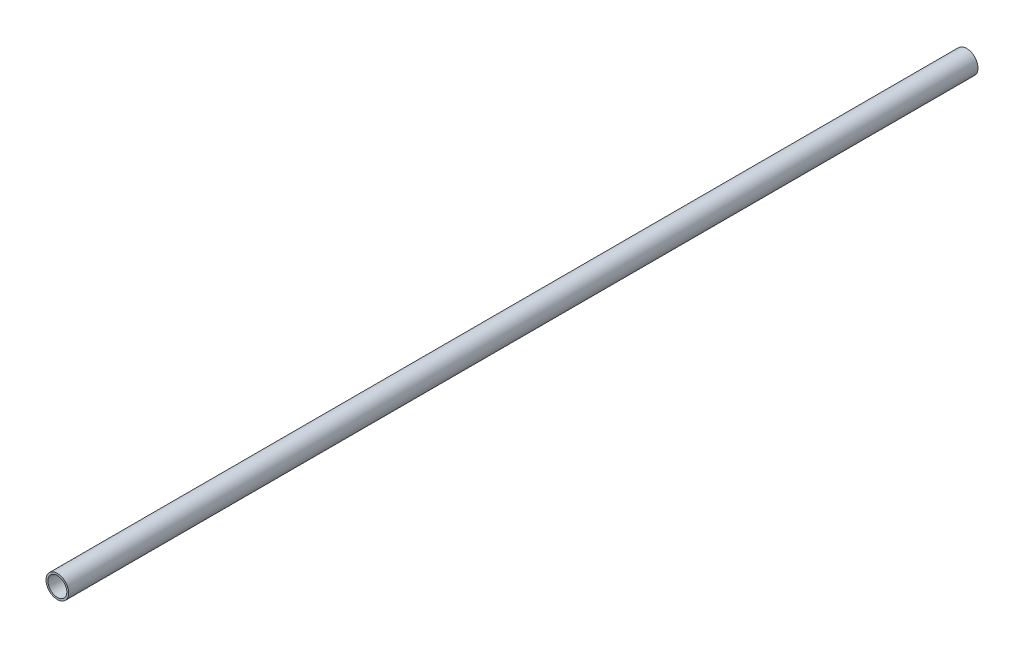
ISO-10303-21;
HEADER;
FILE_DESCRIPTION(('STEP AP214'),'2;1');
FILE_NAME('part.step','',(''),(''),'','','');
FILE_SCHEMA(('AUTOMOTIVE_DESIGN { 1 0 10303 214 1 1 1 1 }'));
ENDSEC;
DATA;
#1=APPLICATION_CONTEXT('core data for automotive mechanical design processes');
#2=APPLICATION_PROTOCOL_DEFINITION('international standard','automotive_design',2000,#1);
#3=PRODUCT_CONTEXT('',#1,'mechanical');
#4=PRODUCT('Part','Part','',(#3));
#5=PRODUCT_RELATED_PRODUCT_CATEGORY('part','',(#4));
#6=PRODUCT_DEFINITION_FORMATION('','',#4);
#7=PRODUCT_DEFINITION_CONTEXT('part definition',#1,'design');
#8=PRODUCT_DEFINITION('design','',#6,#7);
#9=PRODUCT_DEFINITION_SHAPE('','',#8);
#10=(LENGTH_UNIT() NAMED_UNIT(*) SI_UNIT(.MILLI.,.METRE.));
#11=(NAMED_UNIT(*) PLANE_ANGLE_UNIT() SI_UNIT($,.RADIAN.));
#12=(NAMED_UNIT(*) SI_UNIT($,.STERADIAN.) SOLID_ANGLE_UNIT());
#13=UNCERTAINTY_MEASURE_WITH_UNIT(LENGTH_MEASURE(1.E-05),#10,'distance_accuracy_value','');
#14=(GEOMETRIC_REPRESENTATION_CONTEXT(3) GLOBAL_UNCERTAINTY_ASSIGNED_CONTEXT((#13)) GLOBAL_UNIT_ASSIGNED_CONTEXT((#10,
#11,#12)) REPRESENTATION_CONTEXT('',''));
#15=CARTESIAN_POINT('',(0.,0.,0.));
#16=DIRECTION('',(0.,0.,1.));
#17=DIRECTION('',(1.,0.,0.));
#18=AXIS2_PLACEMENT_3D('',#15,#16,#17);
#19=CARTESIAN_POINT('',(0.,0.,1524.));
#20=DIRECTION('',(0.,0.,1.));
#21=DIRECTION('',(1.,0.,0.));
#22=AXIS2_PLACEMENT_3D('',#19,#20,#21);
#23=PLANE('',#22);
#24=CARTESIAN_POINT('',(0.,0.,1524.));
#25=DIRECTION('',(0.,0.,1.));
#26=DIRECTION('',(1.,0.,0.));
#27=AXIS2_PLACEMENT_3D('',#24,#25,#26);
#28=CIRCLE('',#27,19.05);
#29=CARTESIAN_POINT('',(19.05,0.,1524.));
#30=VERTEX_POINT('',#29);
#31=EDGE_CURVE('E10',#30,#30,#28,.T.);
#32=ORIENTED_EDGE('',*,*,#31,.T.);
#33=EDGE_LOOP('',(#32));
#34=FACE_BOUND('',#33,.T.);
#35=CARTESIAN_POINT('',(0.,0.,1524.));
#36=DIRECTION('',(0.,0.,1.));
#37=DIRECTION('',(1.,0.,0.));
#38=AXIS2_PLACEMENT_3D('',#35,#36,#37);
#39=CIRCLE('',#38,15.875);
#40=CARTESIAN_POINT('',(15.875,0.,1524.));
#41=VERTEX_POINT('',#40);
#42=EDGE_CURVE('E41',#41,#41,#39,.T.);
#43=ORIENTED_EDGE('',*,*,#42,.F.);
#44=EDGE_LOOP('',(#43));
#45=FACE_BOUND('',#44,.T.);
#46=ADVANCED_FACE('F30',(#34,#45),#23,.T.);
#47=CARTESIAN_POINT('',(0.,0.,0.));
#48=DIRECTION('',(0.,0.,1.));
#49=DIRECTION('',(1.,0.,0.));
#50=AXIS2_PLACEMENT_3D('',#47,#48,#49);
#51=PLANE('',#50);
#52=CARTESIAN_POINT('',(0.,0.,0.));
#53=DIRECTION('',(0.,0.,1.));
#54=DIRECTION('',(1.,0.,0.));
#55=AXIS2_PLACEMENT_3D('',#52,#53,#54);
#56=CIRCLE('',#55,19.05);
#57=CARTESIAN_POINT('',(19.05,0.,0.));
#58=VERTEX_POINT('',#57);
#59=EDGE_CURVE('E34',#58,#58,#56,.T.);
#60=ORIENTED_EDGE('',*,*,#59,.F.);
#61=EDGE_LOOP('',(#60));
#62=FACE_BOUND('',#61,.T.);
#63=CARTESIAN_POINT('',(0.,0.,0.));
#64=DIRECTION('',(0.,0.,1.));
#65=DIRECTION('',(1.,0.,0.));
#66=AXIS2_PLACEMENT_3D('',#63,#64,#65);
#67=CIRCLE('',#66,15.875);
#68=CARTESIAN_POINT('',(15.875,0.,0.));
#69=VERTEX_POINT('',#68);
#70=EDGE_CURVE('E43',#69,#69,#67,.T.);
#71=ORIENTED_EDGE('',*,*,#70,.T.);
#72=EDGE_LOOP('',(#71));
#73=FACE_BOUND('',#72,.T.);
#74=ADVANCED_FACE('F53',(#62,#73),#51,.F.);
#75=CARTESIAN_POINT('',(0.,0.,1524.));
#76=DIRECTION('',(0.,0.,-1.));
#77=DIRECTION('',(-1.,0.,0.));
#78=AXIS2_PLACEMENT_3D('',#75,#76,#77);
#79=CYLINDRICAL_SURFACE('',#78,19.05);
#80=ORIENTED_EDGE('',*,*,#31,.F.);
#81=EDGE_LOOP('',(#80));
#82=FACE_BOUND('',#81,.T.);
#83=ORIENTED_EDGE('',*,*,#59,.T.);
#84=EDGE_LOOP('',(#83));
#85=FACE_BOUND('',#84,.T.);
#86=ADVANCED_FACE('F32',(#82,#85),#79,.T.);
#87=CARTESIAN_POINT('',(0.,0.,1524.));
#88=DIRECTION('',(0.,0.,-1.));
#89=DIRECTION('',(-1.,0.,0.));
#90=AXIS2_PLACEMENT_3D('',#87,#88,#89);
#91=CYLINDRICAL_SURFACE('',#90,15.875);
#92=ORIENTED_EDGE('',*,*,#42,.T.);
#93=EDGE_LOOP('',(#92));
#94=FACE_BOUND('',#93,.T.);
#95=ORIENTED_EDGE('',*,*,#70,.F.);
#96=EDGE_LOOP('',(#95));
#97=FACE_BOUND('',#96,.T.);
#98=ADVANCED_FACE('F49',(#94,#97),#91,.F.);
#99=CLOSED_SHELL('',(#46,#74,#86,#98));
#100=MANIFOLD_SOLID_BREP('B2',#99);
#101=ADVANCED_BREP_SHAPE_REPRESENTATION('',(#18,#100),#14);
#102=SHAPE_DEFINITION_REPRESENTATION(#9,#101);
ENDSEC;
END-ISO-10303-21;
